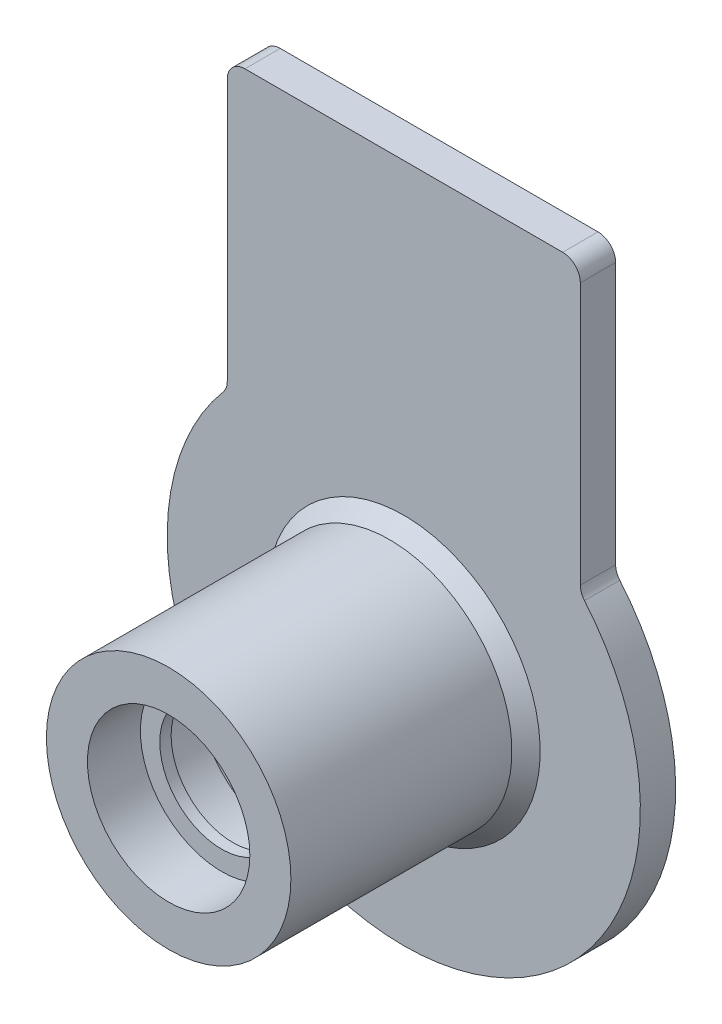
ISO-10303-21;
HEADER;
FILE_DESCRIPTION(('STEP AP214'),'2;1');
FILE_NAME('part.step','',(''),(''),'','','');
FILE_SCHEMA(('AUTOMOTIVE_DESIGN { 1 0 10303 214 1 1 1 1 }'));
ENDSEC;
DATA;
#1=APPLICATION_CONTEXT('core data for automotive mechanical design processes');
#2=APPLICATION_PROTOCOL_DEFINITION('international standard','automotive_design',2000,#1);
#3=PRODUCT_CONTEXT('',#1,'mechanical');
#4=PRODUCT('Part','Part','',(#3));
#5=PRODUCT_RELATED_PRODUCT_CATEGORY('part','',(#4));
#6=PRODUCT_DEFINITION_FORMATION('','',#4);
#7=PRODUCT_DEFINITION_CONTEXT('part definition',#1,'design');
#8=PRODUCT_DEFINITION('design','',#6,#7);
#9=PRODUCT_DEFINITION_SHAPE('','',#8);
#10=(LENGTH_UNIT() NAMED_UNIT(*) SI_UNIT(.MILLI.,.METRE.));
#11=(NAMED_UNIT(*) PLANE_ANGLE_UNIT() SI_UNIT($,.RADIAN.));
#12=(NAMED_UNIT(*) SI_UNIT($,.STERADIAN.) SOLID_ANGLE_UNIT());
#13=UNCERTAINTY_MEASURE_WITH_UNIT(LENGTH_MEASURE(1.E-05),#10,'distance_accuracy_value','');
#14=(GEOMETRIC_REPRESENTATION_CONTEXT(3) GLOBAL_UNCERTAINTY_ASSIGNED_CONTEXT((#13)) GLOBAL_UNIT_ASSIGNED_CONTEXT((#10,
#11,#12)) REPRESENTATION_CONTEXT('',''));
#15=CARTESIAN_POINT('',(0.,0.,0.));
#16=DIRECTION('',(0.,0.,1.));
#17=DIRECTION('',(1.,0.,0.));
#18=AXIS2_PLACEMENT_3D('',#15,#16,#17);
#19=CARTESIAN_POINT('',(-3.5,0.,12.32));
#20=DIRECTION('',(0.,0.,1.));
#21=DIRECTION('',(1.,0.,0.));
#22=AXIS2_PLACEMENT_3D('',#19,#20,#21);
#23=PLANE('',#22);
#24=CARTESIAN_POINT('',(0.,0.,12.32));
#25=DIRECTION('',(0.,0.,-1.));
#26=DIRECTION('',(-1.,0.,0.));
#27=AXIS2_PLACEMENT_3D('',#24,#25,#26);
#28=CIRCLE('',#27,3.5);
#29=CARTESIAN_POINT('',(-3.5,0.,12.32));
#30=VERTEX_POINT('',#29);
#31=EDGE_CURVE('E253',#30,#30,#28,.T.);
#32=ORIENTED_EDGE('',*,*,#31,.T.);
#33=EDGE_LOOP('',(#32));
#34=FACE_BOUND('',#33,.T.);
#35=CARTESIAN_POINT('',(0.,0.,12.32));
#36=DIRECTION('',(0.,0.,1.));
#37=DIRECTION('',(1.,0.,0.));
#38=AXIS2_PLACEMENT_3D('',#35,#36,#37);
#39=CIRCLE('',#38,4.6);
#40=CARTESIAN_POINT('',(4.6,0.,12.32));
#41=VERTEX_POINT('',#40);
#42=EDGE_CURVE('E531',#41,#41,#39,.T.);
#43=ORIENTED_EDGE('',*,*,#42,.T.);
#44=EDGE_LOOP('',(#43));
#45=FACE_BOUND('',#44,.T.);
#46=ADVANCED_FACE('F45',(#34,#45),#23,.T.);
#47=CARTESIAN_POINT('',(0.,0.,0.));
#48=DIRECTION('',(0.,0.,-1.));
#49=DIRECTION('',(-1.,0.,0.));
#50=AXIS2_PLACEMENT_3D('',#47,#48,#49);
#51=CYLINDRICAL_SURFACE('',#50,6.925);
#52=CARTESIAN_POINT('',(0.,0.,2.8));
#53=DIRECTION('',(0.,0.,1.));
#54=DIRECTION('',(1.,0.,0.));
#55=AXIS2_PLACEMENT_3D('',#52,#53,#54);
#56=CIRCLE('',#55,6.925);
#57=CARTESIAN_POINT('',(-6.925,0.,2.8));
#58=VERTEX_POINT('',#57);
#59=EDGE_CURVE('E11',#58,#58,#56,.T.);
#60=ORIENTED_EDGE('',*,*,#59,.T.);
#61=EDGE_LOOP('',(#60));
#62=FACE_BOUND('',#61,.T.);
#63=CARTESIAN_POINT('',(0.,0.,15.32));
#64=DIRECTION('',(0.,0.,1.));
#65=DIRECTION('',(1.,0.,0.));
#66=AXIS2_PLACEMENT_3D('',#63,#64,#65);
#67=CIRCLE('',#66,6.925);
#68=CARTESIAN_POINT('',(6.925,0.,15.32));
#69=VERTEX_POINT('',#68);
#70=EDGE_CURVE('E246',#69,#69,#67,.T.);
#71=ORIENTED_EDGE('',*,*,#70,.F.);
#72=EDGE_LOOP('',(#71));
#73=FACE_BOUND('',#72,.T.);
#74=ADVANCED_FACE('F206',(#62,#73),#51,.T.);
#75=CARTESIAN_POINT('',(-13.4,0.,2.));
#76=DIRECTION('',(0.,0.,1.));
#77=DIRECTION('',(1.,0.,0.));
#78=AXIS2_PLACEMENT_3D('',#75,#76,#77);
#79=PLANE('',#78);
#80=CARTESIAN_POINT('',(0.,0.,2.));
#81=DIRECTION('',(0.,0.,1.));
#82=DIRECTION('',(1.,0.,0.));
#83=AXIS2_PLACEMENT_3D('',#80,#81,#82);
#84=CIRCLE('',#83,7.725);
#85=CARTESIAN_POINT('',(-7.725,0.,2.));
#86=VERTEX_POINT('',#85);
#87=EDGE_CURVE('E55',#86,#86,#84,.F.);
#88=ORIENTED_EDGE('',*,*,#87,.T.);
#89=EDGE_LOOP('',(#88));
#90=FACE_BOUND('',#89,.T.);
#91=DIRECTION('',(0.,1.,0.));
#92=VECTOR('',#91,1.);
#93=CARTESIAN_POINT('',(10.,8.9196412483911,2.));
#94=LINE('',#93,#92);
#95=CARTESIAN_POINT('',(10.,9.29300812439116,2.));
#96=VERTEX_POINT('',#95);
#97=CARTESIAN_POINT('',(10.,24.1215762016988,2.));
#98=VERTEX_POINT('',#97);
#99=EDGE_CURVE('E243',#96,#98,#94,.T.);
#100=ORIENTED_EDGE('',*,*,#99,.T.);
#101=CARTESIAN_POINT('',(9.,24.1215762016988,2.));
#102=DIRECTION('',(0.,0.,1.));
#103=DIRECTION('',(1.,0.,0.));
#104=AXIS2_PLACEMENT_3D('',#101,#102,#103);
#105=CIRCLE('',#104,1.);
#106=CARTESIAN_POINT('',(9.,25.1215762016988,2.));
#107=VERTEX_POINT('',#106);
#108=EDGE_CURVE('E159',#98,#107,#105,.T.);
#109=ORIENTED_EDGE('',*,*,#108,.T.);
#110=DIRECTION('',(-1.,0.,0.));
#111=VECTOR('',#110,1.);
#112=CARTESIAN_POINT('',(10.,25.1215762016988,2.));
#113=LINE('',#112,#111);
#114=CARTESIAN_POINT('',(-9.,25.1215762016988,2.));
#115=VERTEX_POINT('',#114);
#116=EDGE_CURVE('E236',#107,#115,#113,.T.);
#117=ORIENTED_EDGE('',*,*,#116,.T.);
#118=CARTESIAN_POINT('',(-9.,24.1215762016988,2.));
#119=DIRECTION('',(0.,0.,1.));
#120=DIRECTION('',(1.,0.,0.));
#121=AXIS2_PLACEMENT_3D('',#118,#119,#120);
#122=CIRCLE('',#121,1.);
#123=CARTESIAN_POINT('',(-10.,24.1215762016988,2.));
#124=VERTEX_POINT('',#123);
#125=EDGE_CURVE('E156',#115,#124,#122,.T.);
#126=ORIENTED_EDGE('',*,*,#125,.T.);
#127=DIRECTION('',(0.,-1.,0.));
#128=VECTOR('',#127,1.);
#129=CARTESIAN_POINT('',(-10.,25.1215762016988,2.));
#130=LINE('',#129,#128);
#131=CARTESIAN_POINT('',(-10.,9.29300812439116,2.));
#132=VERTEX_POINT('',#131);
#133=EDGE_CURVE('E231',#124,#132,#130,.T.);
#134=ORIENTED_EDGE('',*,*,#133,.T.);
#135=CARTESIAN_POINT('',(-11.,9.29300812439116,2.));
#136=DIRECTION('',(0.,0.,1.));
#137=DIRECTION('',(1.,0.,0.));
#138=AXIS2_PLACEMENT_3D('',#135,#136,#137);
#139=CIRCLE('',#138,1.);
#140=CARTESIAN_POINT('',(-10.2361111111111,8.6476603379751,2.));
#141=VERTEX_POINT('',#140);
#142=EDGE_CURVE('E141',#132,#141,#139,.F.);
#143=ORIENTED_EDGE('',*,*,#142,.T.);
#144=CARTESIAN_POINT('',(0.,0.,2.));
#145=DIRECTION('',(0.,0.,-1.));
#146=DIRECTION('',(-1.,0.,0.));
#147=AXIS2_PLACEMENT_3D('',#144,#145,#146);
#148=CIRCLE('',#147,13.4);
#149=CARTESIAN_POINT('',(10.2361111111111,8.6476603379751,2.));
#150=VERTEX_POINT('',#149);
#151=EDGE_CURVE('E132',#150,#141,#148,.T.);
#152=ORIENTED_EDGE('',*,*,#151,.F.);
#153=CARTESIAN_POINT('',(11.,9.29300812439116,2.));
#154=DIRECTION('',(0.,0.,1.));
#155=DIRECTION('',(1.,0.,0.));
#156=AXIS2_PLACEMENT_3D('',#153,#154,#155);
#157=CIRCLE('',#156,1.);
#158=EDGE_CURVE('E114',#150,#96,#157,.F.);
#159=ORIENTED_EDGE('',*,*,#158,.T.);
#160=EDGE_LOOP('',(#100,#109,#117,#126,#134,#143,#152,#159));
#161=FACE_BOUND('',#160,.T.);
#162=ADVANCED_FACE('F139',(#90,#161),#79,.T.);
#163=CARTESIAN_POINT('',(0.,0.,0.));
#164=DIRECTION('',(0.,0.,-1.));
#165=DIRECTION('',(-1.,0.,0.));
#166=AXIS2_PLACEMENT_3D('',#163,#164,#165);
#167=CYLINDRICAL_SURFACE('',#166,13.4);
#168=CARTESIAN_POINT('',(0.,0.,0.));
#169=DIRECTION('',(0.,0.,-1.));
#170=DIRECTION('',(-1.,0.,0.));
#171=AXIS2_PLACEMENT_3D('',#168,#169,#170);
#172=CIRCLE('',#171,13.4);
#173=CARTESIAN_POINT('',(10.2361111111111,8.6476603379751,0.));
#174=VERTEX_POINT('',#173);
#175=CARTESIAN_POINT('',(-10.2361111111111,8.6476603379751,0.));
#176=VERTEX_POINT('',#175);
#177=EDGE_CURVE('E134',#174,#176,#172,.T.);
#178=ORIENTED_EDGE('',*,*,#177,.F.);
#179=DIRECTION('',(0.,0.,-1.));
#180=VECTOR('',#179,1.);
#181=CARTESIAN_POINT('',(10.2361111111111,8.6476603379751,0.));
#182=LINE('',#181,#180);
#183=EDGE_CURVE('E118',#174,#150,#182,.F.);
#184=ORIENTED_EDGE('',*,*,#183,.T.);
#185=ORIENTED_EDGE('',*,*,#151,.T.);
#186=DIRECTION('',(0.,0.,-1.));
#187=VECTOR('',#186,1.);
#188=CARTESIAN_POINT('',(-10.2361111111111,8.64766033797511,0.));
#189=LINE('',#188,#187);
#190=EDGE_CURVE('E137',#141,#176,#189,.T.);
#191=ORIENTED_EDGE('',*,*,#190,.T.);
#192=EDGE_LOOP('',(#178,#184,#185,#191));
#193=FACE_BOUND('',#192,.T.);
#194=ADVANCED_FACE('F131',(#193),#167,.T.);
#195=CARTESIAN_POINT('',(-5.,0.,0.));
#196=DIRECTION('',(0.,0.,-1.));
#197=DIRECTION('',(-1.,0.,0.));
#198=AXIS2_PLACEMENT_3D('',#195,#196,#197);
#199=PLANE('',#198);
#200=DIRECTION('',(-1.,0.,0.));
#201=VECTOR('',#200,1.);
#202=CARTESIAN_POINT('',(10.,25.1215762016988,0.));
#203=LINE('',#202,#201);
#204=CARTESIAN_POINT('',(9.,25.1215762016988,0.));
#205=VERTEX_POINT('',#204);
#206=CARTESIAN_POINT('',(-9.,25.1215762016988,0.));
#207=VERTEX_POINT('',#206);
#208=EDGE_CURVE('E241',#205,#207,#203,.T.);
#209=ORIENTED_EDGE('',*,*,#208,.F.);
#210=CARTESIAN_POINT('',(9.,24.1215762016988,0.));
#211=DIRECTION('',(0.,0.,-1.));
#212=DIRECTION('',(-1.,0.,0.));
#213=AXIS2_PLACEMENT_3D('',#210,#211,#212);
#214=CIRCLE('',#213,1.);
#215=CARTESIAN_POINT('',(10.,24.1215762016988,0.));
#216=VERTEX_POINT('',#215);
#217=EDGE_CURVE('E172',#205,#216,#214,.T.);
#218=ORIENTED_EDGE('',*,*,#217,.T.);
#219=DIRECTION('',(0.,1.,0.));
#220=VECTOR('',#219,1.);
#221=CARTESIAN_POINT('',(10.,8.9196412483911,0.));
#222=LINE('',#221,#220);
#223=CARTESIAN_POINT('',(10.,9.29300812439116,0.));
#224=VERTEX_POINT('',#223);
#225=EDGE_CURVE('E235',#224,#216,#222,.T.);
#226=ORIENTED_EDGE('',*,*,#225,.F.);
#227=CARTESIAN_POINT('',(11.,9.29300812439116,0.));
#228=DIRECTION('',(0.,0.,-1.));
#229=DIRECTION('',(-1.,0.,0.));
#230=AXIS2_PLACEMENT_3D('',#227,#228,#229);
#231=CIRCLE('',#230,1.);
#232=EDGE_CURVE('E125',#224,#174,#231,.F.);
#233=ORIENTED_EDGE('',*,*,#232,.T.);
#234=ORIENTED_EDGE('',*,*,#177,.T.);
#235=CARTESIAN_POINT('',(-11.,9.29300812439116,0.));
#236=DIRECTION('',(0.,0.,-1.));
#237=DIRECTION('',(-1.,0.,0.));
#238=AXIS2_PLACEMENT_3D('',#235,#236,#237);
#239=CIRCLE('',#238,1.);
#240=CARTESIAN_POINT('',(-10.,9.29300812439116,0.));
#241=VERTEX_POINT('',#240);
#242=EDGE_CURVE('E62',#176,#241,#239,.F.);
#243=ORIENTED_EDGE('',*,*,#242,.T.);
#244=DIRECTION('',(0.,-1.,0.));
#245=VECTOR('',#244,1.);
#246=CARTESIAN_POINT('',(-10.,25.1215762016988,0.));
#247=LINE('',#246,#245);
#248=CARTESIAN_POINT('',(-10.,24.1215762016988,0.));
#249=VERTEX_POINT('',#248);
#250=EDGE_CURVE('E232',#249,#241,#247,.T.);
#251=ORIENTED_EDGE('',*,*,#250,.F.);
#252=CARTESIAN_POINT('',(-9.,24.1215762016988,0.));
#253=DIRECTION('',(0.,0.,-1.));
#254=DIRECTION('',(-1.,0.,0.));
#255=AXIS2_PLACEMENT_3D('',#252,#253,#254);
#256=CIRCLE('',#255,1.);
#257=EDGE_CURVE('E169',#249,#207,#256,.T.);
#258=ORIENTED_EDGE('',*,*,#257,.T.);
#259=EDGE_LOOP('',(#209,#218,#226,#233,#234,#243,#251,#258));
#260=FACE_BOUND('',#259,.T.);
#261=CARTESIAN_POINT('',(0.,0.,0.));
#262=DIRECTION('',(0.,0.,-1.));
#263=DIRECTION('',(-1.,0.,0.));
#264=AXIS2_PLACEMENT_3D('',#261,#262,#263);
#265=CIRCLE('',#264,5.);
#266=CARTESIAN_POINT('',(-5.,0.,0.));
#267=VERTEX_POINT('',#266);
#268=EDGE_CURVE('E147',#267,#267,#265,.T.);
#269=ORIENTED_EDGE('',*,*,#268,.F.);
#270=EDGE_LOOP('',(#269));
#271=FACE_BOUND('',#270,.T.);
#272=ADVANCED_FACE('F289',(#260,#271),#199,.T.);
#273=CARTESIAN_POINT('',(0.,0.,0.));
#274=DIRECTION('',(0.,0.,-1.));
#275=DIRECTION('',(-1.,0.,0.));
#276=AXIS2_PLACEMENT_3D('',#273,#274,#275);
#277=CYLINDRICAL_SURFACE('',#276,5.);
#278=ORIENTED_EDGE('',*,*,#268,.T.);
#279=EDGE_LOOP('',(#278));
#280=FACE_BOUND('',#279,.T.);
#281=CARTESIAN_POINT('',(0.,0.,7.5));
#282=DIRECTION('',(0.,0.,-1.));
#283=DIRECTION('',(-1.,0.,0.));
#284=AXIS2_PLACEMENT_3D('',#281,#282,#283);
#285=CIRCLE('',#284,5.);
#286=CARTESIAN_POINT('',(-5.,0.,7.5));
#287=VERTEX_POINT('',#286);
#288=EDGE_CURVE('E279',#287,#287,#285,.T.);
#289=ORIENTED_EDGE('',*,*,#288,.F.);
#290=EDGE_LOOP('',(#289));
#291=FACE_BOUND('',#290,.T.);
#292=ADVANCED_FACE('F286',(#280,#291),#277,.F.);
#293=CARTESIAN_POINT('',(-3.45,0.,7.5));
#294=DIRECTION('',(0.,0.,-1.));
#295=DIRECTION('',(-1.,0.,0.));
#296=AXIS2_PLACEMENT_3D('',#293,#294,#295);
#297=PLANE('',#296);
#298=ORIENTED_EDGE('',*,*,#288,.T.);
#299=EDGE_LOOP('',(#298));
#300=FACE_BOUND('',#299,.T.);
#301=CARTESIAN_POINT('',(0.,0.,7.5));
#302=DIRECTION('',(0.,0.,-1.));
#303=DIRECTION('',(-1.,0.,0.));
#304=AXIS2_PLACEMENT_3D('',#301,#302,#303);
#305=CIRCLE('',#304,3.45);
#306=CARTESIAN_POINT('',(-3.45,0.,7.5));
#307=VERTEX_POINT('',#306);
#308=EDGE_CURVE('E275',#307,#307,#305,.T.);
#309=ORIENTED_EDGE('',*,*,#308,.F.);
#310=EDGE_LOOP('',(#309));
#311=FACE_BOUND('',#310,.T.);
#312=ADVANCED_FACE('F296',(#300,#311),#297,.T.);
#313=CARTESIAN_POINT('',(0.,0.,0.));
#314=DIRECTION('',(0.,0.,-1.));
#315=DIRECTION('',(-1.,0.,0.));
#316=AXIS2_PLACEMENT_3D('',#313,#314,#315);
#317=CYLINDRICAL_SURFACE('',#316,3.45);
#318=ORIENTED_EDGE('',*,*,#308,.T.);
#319=EDGE_LOOP('',(#318));
#320=FACE_BOUND('',#319,.T.);
#321=CARTESIAN_POINT('',(0.,0.,8.7));
#322=DIRECTION('',(0.,0.,-1.));
#323=DIRECTION('',(-1.,0.,0.));
#324=AXIS2_PLACEMENT_3D('',#321,#322,#323);
#325=CIRCLE('',#324,3.45);
#326=CARTESIAN_POINT('',(-3.45,0.,8.7));
#327=VERTEX_POINT('',#326);
#328=EDGE_CURVE('E271',#327,#327,#325,.T.);
#329=ORIENTED_EDGE('',*,*,#328,.F.);
#330=EDGE_LOOP('',(#329));
#331=FACE_BOUND('',#330,.T.);
#332=ADVANCED_FACE('F438',(#320,#331),#317,.F.);
#333=CARTESIAN_POINT('',(-4.925,0.,8.7));
#334=DIRECTION('',(0.,0.,1.));
#335=DIRECTION('',(1.,0.,0.));
#336=AXIS2_PLACEMENT_3D('',#333,#334,#335);
#337=PLANE('',#336);
#338=ORIENTED_EDGE('',*,*,#328,.T.);
#339=EDGE_LOOP('',(#338));
#340=FACE_BOUND('',#339,.T.);
#341=CARTESIAN_POINT('',(0.,0.,8.7));
#342=DIRECTION('',(0.,0.,-1.));
#343=DIRECTION('',(-1.,0.,0.));
#344=AXIS2_PLACEMENT_3D('',#341,#342,#343);
#345=CIRCLE('',#344,4.925);
#346=CARTESIAN_POINT('',(-4.925,0.,8.7));
#347=VERTEX_POINT('',#346);
#348=EDGE_CURVE('E267',#347,#347,#345,.T.);
#349=ORIENTED_EDGE('',*,*,#348,.F.);
#350=EDGE_LOOP('',(#349));
#351=FACE_BOUND('',#350,.T.);
#352=ADVANCED_FACE('F434',(#340,#351),#337,.T.);
#353=CARTESIAN_POINT('',(0.,0.,0.));
#354=DIRECTION('',(0.,0.,-1.));
#355=DIRECTION('',(-1.,0.,0.));
#356=AXIS2_PLACEMENT_3D('',#353,#354,#355);
#357=CYLINDRICAL_SURFACE('',#356,4.925);
#358=ORIENTED_EDGE('',*,*,#348,.T.);
#359=EDGE_LOOP('',(#358));
#360=FACE_BOUND('',#359,.T.);
#361=CARTESIAN_POINT('',(0.,0.,11.2));
#362=DIRECTION('',(0.,0.,-1.));
#363=DIRECTION('',(-1.,0.,0.));
#364=AXIS2_PLACEMENT_3D('',#361,#362,#363);
#365=CIRCLE('',#364,4.925);
#366=CARTESIAN_POINT('',(-4.925,0.,11.2));
#367=VERTEX_POINT('',#366);
#368=EDGE_CURVE('E263',#367,#367,#365,.T.);
#369=ORIENTED_EDGE('',*,*,#368,.F.);
#370=EDGE_LOOP('',(#369));
#371=FACE_BOUND('',#370,.T.);
#372=ADVANCED_FACE('F430',(#360,#371),#357,.F.);
#373=CARTESIAN_POINT('',(0.,0.,11.68));
#374=DIRECTION('',(0.,0.,-1.));
#375=DIRECTION('',(-1.,0.,0.));
#376=AXIS2_PLACEMENT_3D('',#373,#374,#375);
#377=CONICAL_SURFACE('',#376,3.5,1.24589120872978);
#378=ORIENTED_EDGE('',*,*,#368,.T.);
#379=EDGE_LOOP('',(#378));
#380=FACE_BOUND('',#379,.T.);
#381=CARTESIAN_POINT('',(0.,0.,11.68));
#382=DIRECTION('',(0.,0.,-1.));
#383=DIRECTION('',(-1.,0.,0.));
#384=AXIS2_PLACEMENT_3D('',#381,#382,#383);
#385=CIRCLE('',#384,3.5);
#386=CARTESIAN_POINT('',(-3.5,0.,11.68));
#387=VERTEX_POINT('',#386);
#388=EDGE_CURVE('E259',#387,#387,#385,.T.);
#389=ORIENTED_EDGE('',*,*,#388,.F.);
#390=EDGE_LOOP('',(#389));
#391=FACE_BOUND('',#390,.T.);
#392=ADVANCED_FACE('F426',(#380,#391),#377,.F.);
#393=CARTESIAN_POINT('',(0.,0.,0.));
#394=DIRECTION('',(0.,0.,-1.));
#395=DIRECTION('',(-1.,0.,0.));
#396=AXIS2_PLACEMENT_3D('',#393,#394,#395);
#397=CYLINDRICAL_SURFACE('',#396,3.5);
#398=ORIENTED_EDGE('',*,*,#388,.T.);
#399=EDGE_LOOP('',(#398));
#400=FACE_BOUND('',#399,.T.);
#401=ORIENTED_EDGE('',*,*,#31,.F.);
#402=EDGE_LOOP('',(#401));
#403=FACE_BOUND('',#402,.T.);
#404=ADVANCED_FACE('F317',(#400,#403),#397,.F.);
#405=CARTESIAN_POINT('',(10.,8.9196412483911,-25.7391277286394));
#406=DIRECTION('',(1.,0.,0.));
#407=DIRECTION('',(0.,1.,0.));
#408=AXIS2_PLACEMENT_3D('',#405,#406,#407);
#409=PLANE('',#408);
#410=ORIENTED_EDGE('',*,*,#99,.F.);
#411=DIRECTION('',(0.,0.,1.));
#412=VECTOR('',#411,1.);
#413=CARTESIAN_POINT('',(10.,9.29300812439116,0.));
#414=LINE('',#413,#412);
#415=EDGE_CURVE('E119',#96,#224,#414,.F.);
#416=ORIENTED_EDGE('',*,*,#415,.T.);
#417=ORIENTED_EDGE('',*,*,#225,.T.);
#418=DIRECTION('',(0.,0.,1.));
#419=VECTOR('',#418,1.);
#420=CARTESIAN_POINT('',(10.,24.1215762016988,-25.7391277286394));
#421=LINE('',#420,#419);
#422=EDGE_CURVE('E136',#216,#98,#421,.T.);
#423=ORIENTED_EDGE('',*,*,#422,.T.);
#424=EDGE_LOOP('',(#410,#416,#417,#423));
#425=FACE_BOUND('',#424,.T.);
#426=ADVANCED_FACE('F328',(#425),#409,.T.);
#427=CARTESIAN_POINT('',(10.,25.1215762016988,-25.7391277286394));
#428=DIRECTION('',(0.,1.,0.));
#429=DIRECTION('',(0.,0.,1.));
#430=AXIS2_PLACEMENT_3D('',#427,#428,#429);
#431=PLANE('',#430);
#432=ORIENTED_EDGE('',*,*,#116,.F.);
#433=DIRECTION('',(0.,0.,1.));
#434=VECTOR('',#433,1.);
#435=CARTESIAN_POINT('',(9.,25.1215762016988,-25.7391277286394));
#436=LINE('',#435,#434);
#437=EDGE_CURVE('E166',#107,#205,#436,.F.);
#438=ORIENTED_EDGE('',*,*,#437,.T.);
#439=ORIENTED_EDGE('',*,*,#208,.T.);
#440=DIRECTION('',(0.,0.,1.));
#441=VECTOR('',#440,1.);
#442=CARTESIAN_POINT('',(-9.,25.1215762016988,-25.7391277286394));
#443=LINE('',#442,#441);
#444=EDGE_CURVE('E162',#207,#115,#443,.T.);
#445=ORIENTED_EDGE('',*,*,#444,.T.);
#446=EDGE_LOOP('',(#432,#438,#439,#445));
#447=FACE_BOUND('',#446,.T.);
#448=ADVANCED_FACE('F332',(#447),#431,.T.);
#449=CARTESIAN_POINT('',(-10.,25.1215762016988,-25.7391277286394));
#450=DIRECTION('',(-1.,0.,0.));
#451=DIRECTION('',(0.,-1.,0.));
#452=AXIS2_PLACEMENT_3D('',#449,#450,#451);
#453=PLANE('',#452);
#454=ORIENTED_EDGE('',*,*,#250,.T.);
#455=DIRECTION('',(0.,0.,1.));
#456=VECTOR('',#455,1.);
#457=CARTESIAN_POINT('',(-10.,9.29300812439116,2.));
#458=LINE('',#457,#456);
#459=EDGE_CURVE('E126',#241,#132,#458,.T.);
#460=ORIENTED_EDGE('',*,*,#459,.T.);
#461=ORIENTED_EDGE('',*,*,#133,.F.);
#462=DIRECTION('',(0.,0.,1.));
#463=VECTOR('',#462,1.);
#464=CARTESIAN_POINT('',(-10.,24.1215762016988,-25.7391277286394));
#465=LINE('',#464,#463);
#466=EDGE_CURVE('E69',#124,#249,#465,.F.);
#467=ORIENTED_EDGE('',*,*,#466,.T.);
#468=EDGE_LOOP('',(#454,#460,#461,#467));
#469=FACE_BOUND('',#468,.T.);
#470=ADVANCED_FACE('F222',(#469),#453,.T.);
#471=CARTESIAN_POINT('',(11.,9.29300812439116,0.));
#472=DIRECTION('',(0.,0.,-1.));
#473=DIRECTION('',(-1.,0.,0.));
#474=AXIS2_PLACEMENT_3D('',#471,#472,#473);
#475=CYLINDRICAL_SURFACE('',#474,1.);
#476=ORIENTED_EDGE('',*,*,#232,.F.);
#477=ORIENTED_EDGE('',*,*,#415,.F.);
#478=ORIENTED_EDGE('',*,*,#158,.F.);
#479=ORIENTED_EDGE('',*,*,#183,.F.);
#480=EDGE_LOOP('',(#476,#477,#478,#479));
#481=FACE_BOUND('',#480,.T.);
#482=ADVANCED_FACE('F117',(#481),#475,.F.);
#483=CARTESIAN_POINT('',(9.,24.1215762016988,-25.7391277286394));
#484=DIRECTION('',(0.,0.,1.));
#485=DIRECTION('',(1.,0.,0.));
#486=AXIS2_PLACEMENT_3D('',#483,#484,#485);
#487=CYLINDRICAL_SURFACE('',#486,1.);
#488=ORIENTED_EDGE('',*,*,#217,.F.);
#489=ORIENTED_EDGE('',*,*,#437,.F.);
#490=ORIENTED_EDGE('',*,*,#108,.F.);
#491=ORIENTED_EDGE('',*,*,#422,.F.);
#492=EDGE_LOOP('',(#488,#489,#490,#491));
#493=FACE_BOUND('',#492,.T.);
#494=ADVANCED_FACE('F221',(#493),#487,.T.);
#495=CARTESIAN_POINT('',(-11.,9.29300812439116,0.));
#496=DIRECTION('',(0.,0.,-1.));
#497=DIRECTION('',(-1.,0.,0.));
#498=AXIS2_PLACEMENT_3D('',#495,#496,#497);
#499=CYLINDRICAL_SURFACE('',#498,1.);
#500=ORIENTED_EDGE('',*,*,#242,.F.);
#501=ORIENTED_EDGE('',*,*,#190,.F.);
#502=ORIENTED_EDGE('',*,*,#142,.F.);
#503=ORIENTED_EDGE('',*,*,#459,.F.);
#504=EDGE_LOOP('',(#500,#501,#502,#503));
#505=FACE_BOUND('',#504,.T.);
#506=ADVANCED_FACE('F202',(#505),#499,.F.);
#507=CARTESIAN_POINT('',(-9.,24.1215762016988,-25.7391277286394));
#508=DIRECTION('',(0.,0.,1.));
#509=DIRECTION('',(1.,0.,0.));
#510=AXIS2_PLACEMENT_3D('',#507,#508,#509);
#511=CYLINDRICAL_SURFACE('',#510,1.);
#512=ORIENTED_EDGE('',*,*,#257,.F.);
#513=ORIENTED_EDGE('',*,*,#466,.F.);
#514=ORIENTED_EDGE('',*,*,#125,.F.);
#515=ORIENTED_EDGE('',*,*,#444,.F.);
#516=EDGE_LOOP('',(#512,#513,#514,#515));
#517=FACE_BOUND('',#516,.T.);
#518=ADVANCED_FACE('F192',(#517),#511,.T.);
#519=CARTESIAN_POINT('',(0.,0.,2.));
#520=DIRECTION('',(0.,0.,-1.));
#521=DIRECTION('',(-1.,0.,0.));
#522=AXIS2_PLACEMENT_3D('',#519,#520,#521);
#523=CONICAL_SURFACE('',#522,7.725,0.785398163397453);
#524=CARTESIAN_POINT('',(-6.925,0.,2.8));
#525=CARTESIAN_POINT('',(-6.93333333333333,0.,2.79166666666667));
#526=CARTESIAN_POINT('',(-6.94166666666667,0.,2.78333333333333));
#527=CARTESIAN_POINT('',(-6.95833333333333,0.,2.76666666666667));
#528=CARTESIAN_POINT('',(-6.96666666666667,0.,2.75833333333333));
#529=CARTESIAN_POINT('',(-6.98333333333333,0.,2.74166666666667));
#530=CARTESIAN_POINT('',(-6.99166666666667,0.,2.73333333333333));
#531=CARTESIAN_POINT('',(-7.00833333333333,0.,2.71666666666667));
#532=CARTESIAN_POINT('',(-7.01666666666667,0.,2.70833333333333));
#533=CARTESIAN_POINT('',(-7.03333333333333,0.,2.69166666666667));
#534=CARTESIAN_POINT('',(-7.04166666666667,0.,2.68333333333333));
#535=CARTESIAN_POINT('',(-7.05833333333333,0.,2.66666666666667));
#536=CARTESIAN_POINT('',(-7.06666666666667,0.,2.65833333333333));
#537=CARTESIAN_POINT('',(-7.08333333333333,0.,2.64166666666667));
#538=CARTESIAN_POINT('',(-7.09166666666667,0.,2.63333333333333));
#539=CARTESIAN_POINT('',(-7.10833333333333,0.,2.61666666666667));
#540=CARTESIAN_POINT('',(-7.11666666666667,0.,2.60833333333333));
#541=CARTESIAN_POINT('',(-7.13333333333333,0.,2.59166666666667));
#542=CARTESIAN_POINT('',(-7.14166666666667,0.,2.58333333333333));
#543=CARTESIAN_POINT('',(-7.15833333333333,0.,2.56666666666667));
#544=CARTESIAN_POINT('',(-7.16666666666667,0.,2.55833333333333));
#545=CARTESIAN_POINT('',(-7.18333333333333,0.,2.54166666666667));
#546=CARTESIAN_POINT('',(-7.19166666666667,0.,2.53333333333333));
#547=CARTESIAN_POINT('',(-7.20833333333333,0.,2.51666666666667));
#548=CARTESIAN_POINT('',(-7.21666666666667,0.,2.50833333333333));
#549=CARTESIAN_POINT('',(-7.23333333333333,0.,2.49166666666667));
#550=CARTESIAN_POINT('',(-7.24166666666667,0.,2.48333333333333));
#551=CARTESIAN_POINT('',(-7.25833333333333,0.,2.46666666666667));
#552=CARTESIAN_POINT('',(-7.26666666666667,0.,2.45833333333333));
#553=CARTESIAN_POINT('',(-7.28333333333333,0.,2.44166666666667));
#554=CARTESIAN_POINT('',(-7.29166666666667,0.,2.43333333333333));
#555=CARTESIAN_POINT('',(-7.30833333333333,0.,2.41666666666667));
#556=CARTESIAN_POINT('',(-7.31666666666667,0.,2.40833333333333));
#557=CARTESIAN_POINT('',(-7.33333333333333,0.,2.39166666666667));
#558=CARTESIAN_POINT('',(-7.34166666666667,0.,2.38333333333333));
#559=CARTESIAN_POINT('',(-7.35833333333334,0.,2.36666666666667));
#560=CARTESIAN_POINT('',(-7.36666666666667,0.,2.35833333333333));
#561=CARTESIAN_POINT('',(-7.38333333333334,0.,2.34166666666667));
#562=CARTESIAN_POINT('',(-7.39166666666667,0.,2.33333333333333));
#563=CARTESIAN_POINT('',(-7.40833333333333,0.,2.31666666666667));
#564=CARTESIAN_POINT('',(-7.41666666666667,0.,2.30833333333333));
#565=CARTESIAN_POINT('',(-7.43333333333334,0.,2.29166666666667));
#566=CARTESIAN_POINT('',(-7.44166666666667,0.,2.28333333333333));
#567=CARTESIAN_POINT('',(-7.45833333333334,0.,2.26666666666667));
#568=CARTESIAN_POINT('',(-7.46666666666667,0.,2.25833333333333));
#569=CARTESIAN_POINT('',(-7.48333333333334,0.,2.24166666666667));
#570=CARTESIAN_POINT('',(-7.49166666666667,0.,2.23333333333333));
#571=CARTESIAN_POINT('',(-7.50833333333334,0.,2.21666666666667));
#572=CARTESIAN_POINT('',(-7.51666666666667,0.,2.20833333333333));
#573=CARTESIAN_POINT('',(-7.53333333333334,0.,2.19166666666667));
#574=CARTESIAN_POINT('',(-7.54166666666667,0.,2.18333333333333));
#575=CARTESIAN_POINT('',(-7.55833333333334,0.,2.16666666666667));
#576=CARTESIAN_POINT('',(-7.56666666666667,0.,2.15833333333333));
#577=CARTESIAN_POINT('',(-7.58333333333334,0.,2.14166666666667));
#578=CARTESIAN_POINT('',(-7.59166666666667,0.,2.13333333333333));
#579=CARTESIAN_POINT('',(-7.60833333333334,0.,2.11666666666667));
#580=CARTESIAN_POINT('',(-7.61666666666667,0.,2.10833333333333));
#581=CARTESIAN_POINT('',(-7.63333333333334,0.,2.09166666666667));
#582=CARTESIAN_POINT('',(-7.64166666666667,0.,2.08333333333333));
#583=CARTESIAN_POINT('',(-7.65833333333334,0.,2.06666666666667));
#584=CARTESIAN_POINT('',(-7.66666666666667,0.,2.05833333333333));
#585=CARTESIAN_POINT('',(-7.68333333333334,0.,2.04166666666667));
#586=CARTESIAN_POINT('',(-7.69166666666667,0.,2.03333333333333));
#587=CARTESIAN_POINT('',(-7.70833333333334,0.,2.01666666666667));
#588=CARTESIAN_POINT('',(-7.71666666666667,0.,2.00833333333333));
#589=CARTESIAN_POINT('',(-7.725,0.,2.));
#590=B_SPLINE_CURVE_WITH_KNOTS('',3,(#524,#525,#526,#527,#528,#529,#530,#531,#532,#533,#534,
#535,#536,#537,#538,#539,#540,#541,#542,#543,#544,#545,#546,#547,#548,#549,#550,#551,#552,#553,
#554,#555,#556,#557,#558,#559,#560,#561,#562,#563,#564,#565,#566,#567,#568,#569,#570,#571,#572,
#573,#574,#575,#576,#577,#578,#579,#580,#581,#582,#583,#584,#585,#586,#587,#588,#589),
.UNSPECIFIED.,.F.,.F.,(4,2,2,2,2,2,2,2,2,2,2,2,2,2,2,2,2,2,2,2,2,2,2,2,2,2,2,2,2,2,2,2,4),(0.,
0.0353553390593275,0.0707106781186553,0.106066017177982,0.14142135623731,0.176776695296637,
0.212132034355965,0.247487373415292,0.28284271247462,0.318198051533947,0.353553390593275,
0.388908729652602,0.424264068711929,0.459619407771257,0.494974746830584,0.530330085889912,
0.565685424949239,0.601040764008567,0.636396103067894,0.671751442127222,0.707106781186549,
0.742462120245877,0.777817459305204,0.813172798364531,0.848528137423859,0.883883476483186,
0.919238815542514,0.954594154601841,0.989949493661169,1.0253048327205,1.06066017177982,
1.09601551083915,1.13137084989848),.UNSPECIFIED.);
#591=EDGE_CURVE('BSEAM48',#58,#86,#590,.T.);
#592=ORIENTED_EDGE('',*,*,#59,.F.);
#593=ORIENTED_EDGE('',*,*,#87,.F.);
#594=ORIENTED_EDGE('',*,*,#591,.T.);
#595=ORIENTED_EDGE('',*,*,#591,.F.);
#596=EDGE_LOOP('',(#592,#594,#593,#595));
#597=FACE_BOUND('',#596,.T.);
#598=ADVANCED_FACE('F48',(#597),#523,.T.);
#599=CARTESIAN_POINT('',(0.,0.,15.32));
#600=DIRECTION('',(0.,0.,1.));
#601=DIRECTION('',(1.,0.,0.));
#602=AXIS2_PLACEMENT_3D('',#599,#600,#601);
#603=PLANE('',#602);
#604=ORIENTED_EDGE('',*,*,#70,.T.);
#605=EDGE_LOOP('',(#604));
#606=FACE_BOUND('',#605,.T.);
#607=CARTESIAN_POINT('',(0.,0.,15.32));
#608=DIRECTION('',(0.,0.,1.));
#609=DIRECTION('',(1.,0.,0.));
#610=AXIS2_PLACEMENT_3D('',#607,#608,#609);
#611=CIRCLE('',#610,4.6);
#612=CARTESIAN_POINT('',(4.6,0.,15.32));
#613=VERTEX_POINT('',#612);
#614=EDGE_CURVE('E528',#613,#613,#611,.T.);
#615=ORIENTED_EDGE('',*,*,#614,.F.);
#616=EDGE_LOOP('',(#615));
#617=FACE_BOUND('',#616,.T.);
#618=ADVANCED_FACE('F191',(#606,#617),#603,.T.);
#619=CARTESIAN_POINT('',(0.,0.,15.32));
#620=DIRECTION('',(0.,0.,-1.));
#621=DIRECTION('',(-1.,0.,0.));
#622=AXIS2_PLACEMENT_3D('',#619,#620,#621);
#623=CYLINDRICAL_SURFACE('',#622,4.6);
#624=ORIENTED_EDGE('',*,*,#614,.T.);
#625=EDGE_LOOP('',(#624));
#626=FACE_BOUND('',#625,.T.);
#627=ORIENTED_EDGE('',*,*,#42,.F.);
#628=EDGE_LOOP('',(#627));
#629=FACE_BOUND('',#628,.T.);
#630=ADVANCED_FACE('F199',(#626,#629),#623,.F.);
#631=CLOSED_SHELL('',(#46,#74,#162,#194,#272,#292,#312,#332,#352,#372,#392,#404,#426,#448,#470,
#482,#494,#506,#518,#598,#618,#630));
#632=MANIFOLD_SOLID_BREP('B2',#631);
#633=ADVANCED_BREP_SHAPE_REPRESENTATION('',(#18,#632),#14);
#634=SHAPE_DEFINITION_REPRESENTATION(#9,#633);
ENDSEC;
END-ISO-10303-21;
